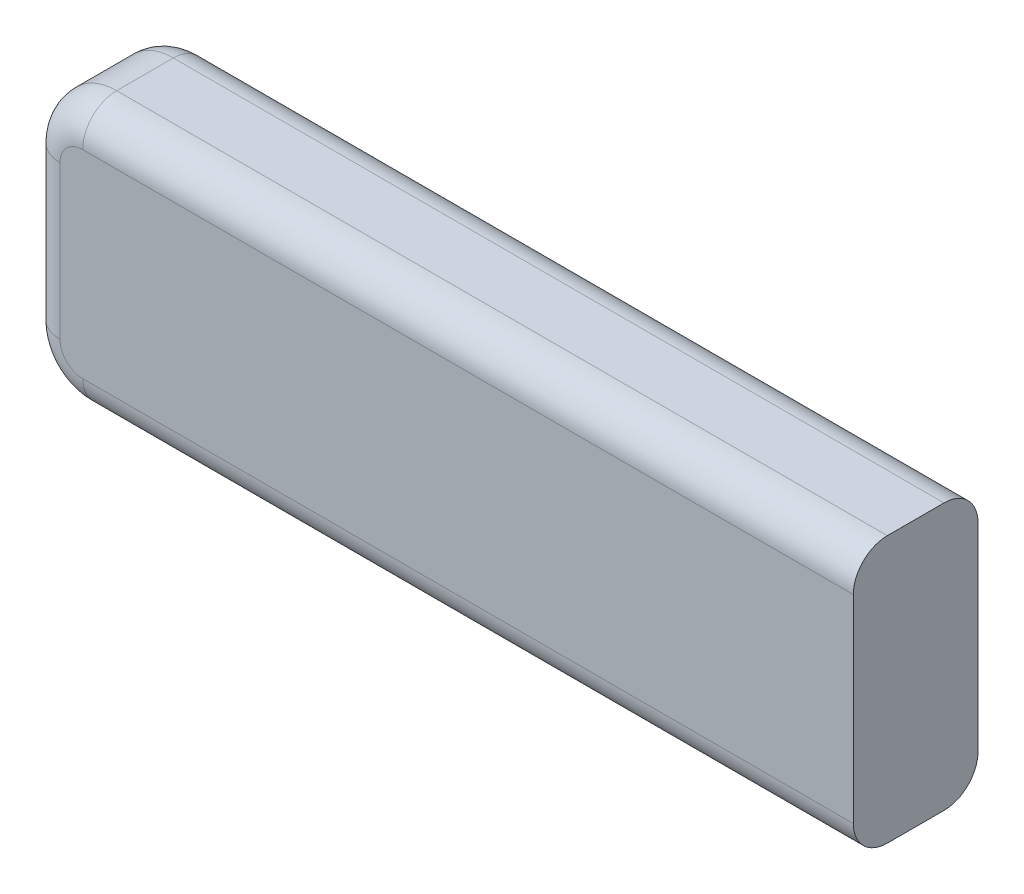
ISO-10303-21;
HEADER;
FILE_DESCRIPTION(('STEP AP214'),'2;1');
FILE_NAME('part.step','',(''),(''),'','','');
FILE_SCHEMA(('AUTOMOTIVE_DESIGN { 1 0 10303 214 1 1 1 1 }'));
ENDSEC;
DATA;
#1=APPLICATION_CONTEXT('core data for automotive mechanical design processes');
#2=APPLICATION_PROTOCOL_DEFINITION('international standard','automotive_design',2000,#1);
#3=PRODUCT_CONTEXT('',#1,'mechanical');
#4=PRODUCT('Part','Part','',(#3));
#5=PRODUCT_RELATED_PRODUCT_CATEGORY('part','',(#4));
#6=PRODUCT_DEFINITION_FORMATION('','',#4);
#7=PRODUCT_DEFINITION_CONTEXT('part definition',#1,'design');
#8=PRODUCT_DEFINITION('design','',#6,#7);
#9=PRODUCT_DEFINITION_SHAPE('','',#8);
#10=(LENGTH_UNIT() NAMED_UNIT(*) SI_UNIT(.MILLI.,.METRE.));
#11=(NAMED_UNIT(*) PLANE_ANGLE_UNIT() SI_UNIT($,.RADIAN.));
#12=(NAMED_UNIT(*) SI_UNIT($,.STERADIAN.) SOLID_ANGLE_UNIT());
#13=UNCERTAINTY_MEASURE_WITH_UNIT(LENGTH_MEASURE(1.E-05),#10,'distance_accuracy_value','');
#14=(GEOMETRIC_REPRESENTATION_CONTEXT(3) GLOBAL_UNCERTAINTY_ASSIGNED_CONTEXT((#13)) GLOBAL_UNIT_ASSIGNED_CONTEXT((#10,
#11,#12)) REPRESENTATION_CONTEXT('',''));
#15=CARTESIAN_POINT('',(0.,0.,0.));
#16=DIRECTION('',(0.,0.,1.));
#17=DIRECTION('',(1.,0.,0.));
#18=AXIS2_PLACEMENT_3D('',#15,#16,#17);
#19=CARTESIAN_POINT('',(0.,0.,5.5));
#20=DIRECTION('',(0.,0.,-1.));
#21=DIRECTION('',(-1.,0.,0.));
#22=AXIS2_PLACEMENT_3D('',#19,#20,#21);
#23=PLANE('',#22);
#24=CARTESIAN_POINT('',(2.5,2.5,5.5));
#25=DIRECTION('',(0.,0.,-1.));
#26=DIRECTION('',(-1.,0.,0.));
#27=AXIS2_PLACEMENT_3D('',#24,#25,#26);
#28=CIRCLE('',#27,1.);
#29=CARTESIAN_POINT('',(2.5,1.5,5.5));
#30=VERTEX_POINT('',#29);
#31=CARTESIAN_POINT('',(1.5,2.5,5.5));
#32=VERTEX_POINT('',#31);
#33=EDGE_CURVE('E203',#30,#32,#28,.T.);
#34=ORIENTED_EDGE('',*,*,#33,.F.);
#35=DIRECTION('',(1.,0.,0.));
#36=VECTOR('',#35,1.);
#37=CARTESIAN_POINT('',(0.,1.5,5.5));
#38=LINE('',#37,#36);
#39=CARTESIAN_POINT('',(36.5,1.5,5.5));
#40=VERTEX_POINT('',#39);
#41=EDGE_CURVE('E176',#30,#40,#38,.T.);
#42=ORIENTED_EDGE('',*,*,#41,.T.);
#43=DIRECTION('',(0.,1.,0.));
#44=VECTOR('',#43,1.);
#45=CARTESIAN_POINT('',(36.5,0.,5.5));
#46=LINE('',#45,#44);
#47=CARTESIAN_POINT('',(36.5,10.25,5.5));
#48=VERTEX_POINT('',#47);
#49=EDGE_CURVE('E140',#40,#48,#46,.T.);
#50=ORIENTED_EDGE('',*,*,#49,.T.);
#51=DIRECTION('',(-1.,0.,0.));
#52=VECTOR('',#51,1.);
#53=CARTESIAN_POINT('',(0.,10.25,5.5));
#54=LINE('',#53,#52);
#55=CARTESIAN_POINT('',(2.5,10.25,5.5));
#56=VERTEX_POINT('',#55);
#57=EDGE_CURVE('E170',#48,#56,#54,.T.);
#58=ORIENTED_EDGE('',*,*,#57,.T.);
#59=CARTESIAN_POINT('',(2.5,9.25,5.5));
#60=DIRECTION('',(0.,0.,-1.));
#61=DIRECTION('',(-1.,0.,0.));
#62=AXIS2_PLACEMENT_3D('',#59,#60,#61);
#63=CIRCLE('',#62,1.);
#64=CARTESIAN_POINT('',(1.5,9.25,5.5));
#65=VERTEX_POINT('',#64);
#66=EDGE_CURVE('E200',#65,#56,#63,.T.);
#67=ORIENTED_EDGE('',*,*,#66,.F.);
#68=DIRECTION('',(0.,-1.,0.));
#69=VECTOR('',#68,1.);
#70=CARTESIAN_POINT('',(1.5,0.,5.5));
#71=LINE('',#70,#69);
#72=EDGE_CURVE('E173',#65,#32,#71,.T.);
#73=ORIENTED_EDGE('',*,*,#72,.T.);
#74=EDGE_LOOP('',(#34,#42,#50,#58,#67,#73));
#75=FACE_BOUND('',#74,.T.);
#76=ADVANCED_FACE('F41',(#75),#23,.F.);
#77=CARTESIAN_POINT('',(0.,0.,0.));
#78=DIRECTION('',(0.,0.,-1.));
#79=DIRECTION('',(-1.,0.,0.));
#80=AXIS2_PLACEMENT_3D('',#77,#78,#79);
#81=PLANE('',#80);
#82=CARTESIAN_POINT('',(2.5,2.5,0.));
#83=DIRECTION('',(0.,0.,-1.));
#84=DIRECTION('',(-1.,0.,0.));
#85=AXIS2_PLACEMENT_3D('',#82,#83,#84);
#86=CIRCLE('',#85,1.);
#87=CARTESIAN_POINT('',(1.5,2.5,0.));
#88=VERTEX_POINT('',#87);
#89=CARTESIAN_POINT('',(2.5,1.5,0.));
#90=VERTEX_POINT('',#89);
#91=EDGE_CURVE('E191',#88,#90,#86,.F.);
#92=ORIENTED_EDGE('',*,*,#91,.F.);
#93=DIRECTION('',(0.,-1.,0.));
#94=VECTOR('',#93,1.);
#95=CARTESIAN_POINT('',(1.5,11.75,0.));
#96=LINE('',#95,#94);
#97=CARTESIAN_POINT('',(1.5,9.25,0.));
#98=VERTEX_POINT('',#97);
#99=EDGE_CURVE('E164',#88,#98,#96,.F.);
#100=ORIENTED_EDGE('',*,*,#99,.T.);
#101=CARTESIAN_POINT('',(2.5,9.25,0.));
#102=DIRECTION('',(0.,0.,-1.));
#103=DIRECTION('',(-1.,0.,0.));
#104=AXIS2_PLACEMENT_3D('',#101,#102,#103);
#105=CIRCLE('',#104,1.);
#106=CARTESIAN_POINT('',(2.5,10.25,0.));
#107=VERTEX_POINT('',#106);
#108=EDGE_CURVE('E188',#107,#98,#105,.F.);
#109=ORIENTED_EDGE('',*,*,#108,.F.);
#110=DIRECTION('',(-1.,0.,0.));
#111=VECTOR('',#110,1.);
#112=CARTESIAN_POINT('',(36.5,10.25,0.));
#113=LINE('',#112,#111);
#114=CARTESIAN_POINT('',(36.5,10.25,0.));
#115=VERTEX_POINT('',#114);
#116=EDGE_CURVE('E162',#107,#115,#113,.F.);
#117=ORIENTED_EDGE('',*,*,#116,.T.);
#118=DIRECTION('',(0.,1.,0.));
#119=VECTOR('',#118,1.);
#120=CARTESIAN_POINT('',(36.5,0.,0.));
#121=LINE('',#120,#119);
#122=CARTESIAN_POINT('',(36.5,1.5,0.));
#123=VERTEX_POINT('',#122);
#124=EDGE_CURVE('E224',#123,#115,#121,.T.);
#125=ORIENTED_EDGE('',*,*,#124,.F.);
#126=DIRECTION('',(1.,0.,0.));
#127=VECTOR('',#126,1.);
#128=CARTESIAN_POINT('',(0.,1.5,0.));
#129=LINE('',#128,#127);
#130=EDGE_CURVE('E167',#123,#90,#129,.F.);
#131=ORIENTED_EDGE('',*,*,#130,.T.);
#132=EDGE_LOOP('',(#92,#100,#109,#117,#125,#131));
#133=FACE_BOUND('',#132,.T.);
#134=ADVANCED_FACE('F269',(#133),#81,.T.);
#135=CARTESIAN_POINT('',(0.,0.,5.5));
#136=DIRECTION('',(1.,0.,0.));
#137=DIRECTION('',(0.,0.,-1.));
#138=AXIS2_PLACEMENT_3D('',#135,#136,#137);
#139=PLANE('',#138);
#140=DIRECTION('',(0.,-1.,0.));
#141=VECTOR('',#140,1.);
#142=CARTESIAN_POINT('',(0.,0.,4.));
#143=LINE('',#142,#141);
#144=CARTESIAN_POINT('',(0.,2.5,4.));
#145=VERTEX_POINT('',#144);
#146=CARTESIAN_POINT('',(0.,9.25,4.));
#147=VERTEX_POINT('',#146);
#148=EDGE_CURVE('E178',#145,#147,#143,.F.);
#149=ORIENTED_EDGE('',*,*,#148,.T.);
#150=DIRECTION('',(0.,0.,-1.));
#151=VECTOR('',#150,1.);
#152=CARTESIAN_POINT('',(0.,9.25,5.5));
#153=LINE('',#152,#151);
#154=CARTESIAN_POINT('',(0.,9.25,1.5));
#155=VERTEX_POINT('',#154);
#156=EDGE_CURVE('E216',#147,#155,#153,.T.);
#157=ORIENTED_EDGE('',*,*,#156,.T.);
#158=DIRECTION('',(0.,-1.,0.));
#159=VECTOR('',#158,1.);
#160=CARTESIAN_POINT('',(0.,0.,1.5));
#161=LINE('',#160,#159);
#162=CARTESIAN_POINT('',(0.,2.5,1.5));
#163=VERTEX_POINT('',#162);
#164=EDGE_CURVE('E181',#155,#163,#161,.T.);
#165=ORIENTED_EDGE('',*,*,#164,.T.);
#166=DIRECTION('',(0.,0.,-1.));
#167=VECTOR('',#166,1.);
#168=CARTESIAN_POINT('',(0.,2.5,5.5));
#169=LINE('',#168,#167);
#170=EDGE_CURVE('E214',#163,#145,#169,.F.);
#171=ORIENTED_EDGE('',*,*,#170,.T.);
#172=EDGE_LOOP('',(#149,#157,#165,#171));
#173=FACE_BOUND('',#172,.T.);
#174=ADVANCED_FACE('F274',(#173),#139,.F.);
#175=CARTESIAN_POINT('',(0.,0.,5.5));
#176=DIRECTION('',(0.,1.,0.));
#177=DIRECTION('',(0.,0.,1.));
#178=AXIS2_PLACEMENT_3D('',#175,#176,#177);
#179=PLANE('',#178);
#180=DIRECTION('',(1.,0.,0.));
#181=VECTOR('',#180,1.);
#182=CARTESIAN_POINT('',(0.,0.,4.));
#183=LINE('',#182,#181);
#184=CARTESIAN_POINT('',(36.5,0.,4.));
#185=VERTEX_POINT('',#184);
#186=CARTESIAN_POINT('',(2.5,0.,4.));
#187=VERTEX_POINT('',#186);
#188=EDGE_CURVE('E146',#185,#187,#183,.F.);
#189=ORIENTED_EDGE('',*,*,#188,.T.);
#190=DIRECTION('',(0.,0.,-1.));
#191=VECTOR('',#190,1.);
#192=CARTESIAN_POINT('',(2.5,0.,5.5));
#193=LINE('',#192,#191);
#194=CARTESIAN_POINT('',(2.5,0.,1.5));
#195=VERTEX_POINT('',#194);
#196=EDGE_CURVE('E11',#187,#195,#193,.T.);
#197=ORIENTED_EDGE('',*,*,#196,.T.);
#198=DIRECTION('',(1.,0.,0.));
#199=VECTOR('',#198,1.);
#200=CARTESIAN_POINT('',(36.5,0.,1.5));
#201=LINE('',#200,#199);
#202=CARTESIAN_POINT('',(36.5,0.,1.5));
#203=VERTEX_POINT('',#202);
#204=EDGE_CURVE('E149',#195,#203,#201,.T.);
#205=ORIENTED_EDGE('',*,*,#204,.T.);
#206=DIRECTION('',(0.,0.,-1.));
#207=VECTOR('',#206,1.);
#208=CARTESIAN_POINT('',(36.5,0.,5.5));
#209=LINE('',#208,#207);
#210=EDGE_CURVE('E138',#185,#203,#209,.T.);
#211=ORIENTED_EDGE('',*,*,#210,.F.);
#212=EDGE_LOOP('',(#189,#197,#205,#211));
#213=FACE_BOUND('',#212,.T.);
#214=ADVANCED_FACE('F145',(#213),#179,.F.);
#215=CARTESIAN_POINT('',(36.5,0.,5.5));
#216=DIRECTION('',(-1.,0.,0.));
#217=DIRECTION('',(0.,0.,1.));
#218=AXIS2_PLACEMENT_3D('',#215,#216,#217);
#219=PLANE('',#218);
#220=ORIENTED_EDGE('',*,*,#210,.T.);
#221=CARTESIAN_POINT('',(36.5,1.5,1.5));
#222=DIRECTION('',(-1.,0.,0.));
#223=DIRECTION('',(0.,0.,1.));
#224=AXIS2_PLACEMENT_3D('',#221,#222,#223);
#225=CIRCLE('',#224,1.5);
#226=EDGE_CURVE('E141',#203,#123,#225,.F.);
#227=ORIENTED_EDGE('',*,*,#226,.T.);
#228=ORIENTED_EDGE('',*,*,#124,.T.);
#229=CARTESIAN_POINT('',(36.5,10.25,1.5));
#230=DIRECTION('',(-1.,0.,0.));
#231=DIRECTION('',(0.,0.,1.));
#232=AXIS2_PLACEMENT_3D('',#229,#230,#231);
#233=CIRCLE('',#232,1.5);
#234=CARTESIAN_POINT('',(36.5,11.75,1.5));
#235=VERTEX_POINT('',#234);
#236=EDGE_CURVE('E142',#115,#235,#233,.F.);
#237=ORIENTED_EDGE('',*,*,#236,.T.);
#238=DIRECTION('',(0.,0.,-1.));
#239=VECTOR('',#238,1.);
#240=CARTESIAN_POINT('',(36.5,11.75,5.5));
#241=LINE('',#240,#239);
#242=CARTESIAN_POINT('',(36.5,11.75,4.));
#243=VERTEX_POINT('',#242);
#244=EDGE_CURVE('E151',#243,#235,#241,.T.);
#245=ORIENTED_EDGE('',*,*,#244,.F.);
#246=CARTESIAN_POINT('',(36.5,10.25,4.));
#247=DIRECTION('',(-1.,0.,0.));
#248=DIRECTION('',(0.,0.,1.));
#249=AXIS2_PLACEMENT_3D('',#246,#247,#248);
#250=CIRCLE('',#249,1.5);
#251=EDGE_CURVE('E155',#243,#48,#250,.F.);
#252=ORIENTED_EDGE('',*,*,#251,.T.);
#253=ORIENTED_EDGE('',*,*,#49,.F.);
#254=CARTESIAN_POINT('',(36.5,1.5,4.));
#255=DIRECTION('',(-1.,0.,0.));
#256=DIRECTION('',(0.,0.,1.));
#257=AXIS2_PLACEMENT_3D('',#254,#255,#256);
#258=CIRCLE('',#257,1.5);
#259=EDGE_CURVE('E135',#40,#185,#258,.F.);
#260=ORIENTED_EDGE('',*,*,#259,.T.);
#261=EDGE_LOOP('',(#220,#227,#228,#237,#245,#252,#253,#260));
#262=FACE_BOUND('',#261,.T.);
#263=ADVANCED_FACE('F137',(#262),#219,.F.);
#264=CARTESIAN_POINT('',(0.,11.75,5.5));
#265=DIRECTION('',(0.,-1.,0.));
#266=DIRECTION('',(0.,0.,-1.));
#267=AXIS2_PLACEMENT_3D('',#264,#265,#266);
#268=PLANE('',#267);
#269=DIRECTION('',(-1.,0.,0.));
#270=VECTOR('',#269,1.);
#271=CARTESIAN_POINT('',(0.,11.75,1.5));
#272=LINE('',#271,#270);
#273=CARTESIAN_POINT('',(2.5,11.75,1.5));
#274=VERTEX_POINT('',#273);
#275=EDGE_CURVE('E186',#235,#274,#272,.T.);
#276=ORIENTED_EDGE('',*,*,#275,.T.);
#277=DIRECTION('',(0.,0.,-1.));
#278=VECTOR('',#277,1.);
#279=CARTESIAN_POINT('',(2.5,11.75,5.5));
#280=LINE('',#279,#278);
#281=CARTESIAN_POINT('',(2.5,11.75,4.));
#282=VERTEX_POINT('',#281);
#283=EDGE_CURVE('E50',#274,#282,#280,.F.);
#284=ORIENTED_EDGE('',*,*,#283,.T.);
#285=DIRECTION('',(-1.,0.,0.));
#286=VECTOR('',#285,1.);
#287=CARTESIAN_POINT('',(0.,11.75,4.));
#288=LINE('',#287,#286);
#289=EDGE_CURVE('E184',#282,#243,#288,.F.);
#290=ORIENTED_EDGE('',*,*,#289,.T.);
#291=ORIENTED_EDGE('',*,*,#244,.T.);
#292=EDGE_LOOP('',(#276,#284,#290,#291));
#293=FACE_BOUND('',#292,.T.);
#294=ADVANCED_FACE('F257',(#293),#268,.F.);
#295=CARTESIAN_POINT('',(0.,10.25,1.5));
#296=DIRECTION('',(1.,0.,0.));
#297=DIRECTION('',(0.,0.,-1.));
#298=AXIS2_PLACEMENT_3D('',#295,#296,#297);
#299=CYLINDRICAL_SURFACE('',#298,1.5);
#300=ORIENTED_EDGE('',*,*,#116,.F.);
#301=CARTESIAN_POINT('',(2.5,10.25,1.5));
#302=DIRECTION('',(1.,0.,0.));
#303=DIRECTION('',(0.,0.,-1.));
#304=AXIS2_PLACEMENT_3D('',#301,#302,#303);
#305=CIRCLE('',#304,1.5);
#306=EDGE_CURVE('E66',#107,#274,#305,.T.);
#307=ORIENTED_EDGE('',*,*,#306,.T.);
#308=ORIENTED_EDGE('',*,*,#275,.F.);
#309=ORIENTED_EDGE('',*,*,#236,.F.);
#310=EDGE_LOOP('',(#300,#307,#308,#309));
#311=FACE_BOUND('',#310,.T.);
#312=ADVANCED_FACE('F255',(#311),#299,.T.);
#313=CARTESIAN_POINT('',(1.5,0.,1.5));
#314=DIRECTION('',(0.,1.,0.));
#315=DIRECTION('',(0.,0.,1.));
#316=AXIS2_PLACEMENT_3D('',#313,#314,#315);
#317=CYLINDRICAL_SURFACE('',#316,1.5);
#318=ORIENTED_EDGE('',*,*,#164,.F.);
#319=CARTESIAN_POINT('',(1.5,9.25,1.5));
#320=DIRECTION('',(0.,-1.,0.));
#321=DIRECTION('',(0.,0.,-1.));
#322=AXIS2_PLACEMENT_3D('',#319,#320,#321);
#323=CIRCLE('',#322,1.5);
#324=EDGE_CURVE('E208',#155,#98,#323,.T.);
#325=ORIENTED_EDGE('',*,*,#324,.T.);
#326=ORIENTED_EDGE('',*,*,#99,.F.);
#327=CARTESIAN_POINT('',(1.5,2.5,1.5));
#328=DIRECTION('',(0.,1.,0.));
#329=DIRECTION('',(0.,0.,1.));
#330=AXIS2_PLACEMENT_3D('',#327,#328,#329);
#331=CIRCLE('',#330,1.5);
#332=EDGE_CURVE('E206',#88,#163,#331,.T.);
#333=ORIENTED_EDGE('',*,*,#332,.T.);
#334=EDGE_LOOP('',(#318,#325,#326,#333));
#335=FACE_BOUND('',#334,.T.);
#336=ADVANCED_FACE('F264',(#335),#317,.T.);
#337=CARTESIAN_POINT('',(0.,1.5,1.5));
#338=DIRECTION('',(-1.,0.,0.));
#339=DIRECTION('',(0.,0.,1.));
#340=AXIS2_PLACEMENT_3D('',#337,#338,#339);
#341=CYLINDRICAL_SURFACE('',#340,1.5);
#342=ORIENTED_EDGE('',*,*,#204,.F.);
#343=CARTESIAN_POINT('',(2.5,1.5,1.5));
#344=DIRECTION('',(1.,0.,0.));
#345=DIRECTION('',(0.,0.,-1.));
#346=AXIS2_PLACEMENT_3D('',#343,#344,#345);
#347=CIRCLE('',#346,1.5);
#348=EDGE_CURVE('E194',#195,#90,#347,.T.);
#349=ORIENTED_EDGE('',*,*,#348,.T.);
#350=ORIENTED_EDGE('',*,*,#130,.F.);
#351=ORIENTED_EDGE('',*,*,#226,.F.);
#352=EDGE_LOOP('',(#342,#349,#350,#351));
#353=FACE_BOUND('',#352,.T.);
#354=ADVANCED_FACE('F308',(#353),#341,.T.);
#355=CARTESIAN_POINT('',(0.,10.25,4.));
#356=DIRECTION('',(-1.,0.,0.));
#357=DIRECTION('',(0.,0.,1.));
#358=AXIS2_PLACEMENT_3D('',#355,#356,#357);
#359=CYLINDRICAL_SURFACE('',#358,1.5);
#360=ORIENTED_EDGE('',*,*,#289,.F.);
#361=CARTESIAN_POINT('',(2.5,10.25,4.));
#362=DIRECTION('',(1.,0.,0.));
#363=DIRECTION('',(0.,0.,-1.));
#364=AXIS2_PLACEMENT_3D('',#361,#362,#363);
#365=CIRCLE('',#364,1.5);
#366=EDGE_CURVE('E210',#282,#56,#365,.T.);
#367=ORIENTED_EDGE('',*,*,#366,.T.);
#368=ORIENTED_EDGE('',*,*,#57,.F.);
#369=ORIENTED_EDGE('',*,*,#251,.F.);
#370=EDGE_LOOP('',(#360,#367,#368,#369));
#371=FACE_BOUND('',#370,.T.);
#372=ADVANCED_FACE('F242',(#371),#359,.T.);
#373=CARTESIAN_POINT('',(1.5,0.,4.));
#374=DIRECTION('',(0.,-1.,0.));
#375=DIRECTION('',(0.,0.,-1.));
#376=AXIS2_PLACEMENT_3D('',#373,#374,#375);
#377=CYLINDRICAL_SURFACE('',#376,1.5);
#378=ORIENTED_EDGE('',*,*,#148,.F.);
#379=CARTESIAN_POINT('',(1.5,2.5,4.));
#380=DIRECTION('',(0.,1.,0.));
#381=DIRECTION('',(0.,0.,1.));
#382=AXIS2_PLACEMENT_3D('',#379,#380,#381);
#383=CIRCLE('',#382,1.5);
#384=EDGE_CURVE('E198',#145,#32,#383,.T.);
#385=ORIENTED_EDGE('',*,*,#384,.T.);
#386=ORIENTED_EDGE('',*,*,#72,.F.);
#387=CARTESIAN_POINT('',(1.5,9.25,4.));
#388=DIRECTION('',(0.,-1.,0.));
#389=DIRECTION('',(0.,0.,-1.));
#390=AXIS2_PLACEMENT_3D('',#387,#388,#389);
#391=CIRCLE('',#390,1.5);
#392=EDGE_CURVE('E196',#65,#147,#391,.T.);
#393=ORIENTED_EDGE('',*,*,#392,.T.);
#394=EDGE_LOOP('',(#378,#385,#386,#393));
#395=FACE_BOUND('',#394,.T.);
#396=ADVANCED_FACE('F307',(#395),#377,.T.);
#397=CARTESIAN_POINT('',(0.,1.5,4.));
#398=DIRECTION('',(1.,0.,0.));
#399=DIRECTION('',(0.,0.,-1.));
#400=AXIS2_PLACEMENT_3D('',#397,#398,#399);
#401=CYLINDRICAL_SURFACE('',#400,1.5);
#402=ORIENTED_EDGE('',*,*,#41,.F.);
#403=CARTESIAN_POINT('',(2.5,1.5,4.));
#404=DIRECTION('',(1.,0.,0.));
#405=DIRECTION('',(0.,0.,-1.));
#406=AXIS2_PLACEMENT_3D('',#403,#404,#405);
#407=CIRCLE('',#406,1.5);
#408=EDGE_CURVE('E58',#30,#187,#407,.T.);
#409=ORIENTED_EDGE('',*,*,#408,.T.);
#410=ORIENTED_EDGE('',*,*,#188,.F.);
#411=ORIENTED_EDGE('',*,*,#259,.F.);
#412=EDGE_LOOP('',(#402,#409,#410,#411));
#413=FACE_BOUND('',#412,.T.);
#414=ADVANCED_FACE('F153',(#413),#401,.T.);
#415=CARTESIAN_POINT('',(2.5,2.5,4.));
#416=DIRECTION('',(0.,0.,-1.));
#417=DIRECTION('',(-1.,0.,0.));
#418=AXIS2_PLACEMENT_3D('',#415,#416,#417);
#419=DEGENERATE_TOROIDAL_SURFACE('',#418,1.,1.5,.T.);
#420=ORIENTED_EDGE('',*,*,#33,.T.);
#421=ORIENTED_EDGE('',*,*,#384,.F.);
#422=CARTESIAN_POINT('',(2.5,2.5,4.));
#423=DIRECTION('',(0.,0.,-1.));
#424=DIRECTION('',(-1.,0.,0.));
#425=AXIS2_PLACEMENT_3D('',#422,#423,#424);
#426=CIRCLE('',#425,2.5);
#427=EDGE_CURVE('E222',#187,#145,#426,.T.);
#428=ORIENTED_EDGE('',*,*,#427,.F.);
#429=ORIENTED_EDGE('',*,*,#408,.F.);
#430=EDGE_LOOP('',(#420,#421,#428,#429));
#431=FACE_BOUND('',#430,.T.);
#432=ADVANCED_FACE('F294',(#431),#419,.T.);
#433=CARTESIAN_POINT('',(2.5,2.5,5.5));
#434=DIRECTION('',(0.,0.,-1.));
#435=DIRECTION('',(-1.,0.,0.));
#436=AXIS2_PLACEMENT_3D('',#433,#434,#435);
#437=CYLINDRICAL_SURFACE('',#436,2.5);
#438=ORIENTED_EDGE('',*,*,#427,.T.);
#439=ORIENTED_EDGE('',*,*,#170,.F.);
#440=CARTESIAN_POINT('',(2.5,2.5,1.5));
#441=DIRECTION('',(0.,0.,-1.));
#442=DIRECTION('',(-1.,0.,0.));
#443=AXIS2_PLACEMENT_3D('',#440,#441,#442);
#444=CIRCLE('',#443,2.5);
#445=EDGE_CURVE('E219',#195,#163,#444,.T.);
#446=ORIENTED_EDGE('',*,*,#445,.F.);
#447=ORIENTED_EDGE('',*,*,#196,.F.);
#448=EDGE_LOOP('',(#438,#439,#446,#447));
#449=FACE_BOUND('',#448,.T.);
#450=ADVANCED_FACE('F297',(#449),#437,.T.);
#451=CARTESIAN_POINT('',(2.5,2.5,1.5));
#452=DIRECTION('',(0.,0.,-1.));
#453=DIRECTION('',(-1.,0.,0.));
#454=AXIS2_PLACEMENT_3D('',#451,#452,#453);
#455=DEGENERATE_TOROIDAL_SURFACE('',#454,1.,1.5,.T.);
#456=ORIENTED_EDGE('',*,*,#332,.F.);
#457=ORIENTED_EDGE('',*,*,#91,.T.);
#458=ORIENTED_EDGE('',*,*,#348,.F.);
#459=ORIENTED_EDGE('',*,*,#445,.T.);
#460=EDGE_LOOP('',(#456,#457,#458,#459));
#461=FACE_BOUND('',#460,.T.);
#462=ADVANCED_FACE('F301',(#461),#455,.T.);
#463=CARTESIAN_POINT('',(2.5,9.25,4.));
#464=DIRECTION('',(0.,0.,-1.));
#465=DIRECTION('',(-1.,0.,0.));
#466=AXIS2_PLACEMENT_3D('',#463,#464,#465);
#467=DEGENERATE_TOROIDAL_SURFACE('',#466,1.,1.5,.T.);
#468=ORIENTED_EDGE('',*,*,#66,.T.);
#469=ORIENTED_EDGE('',*,*,#366,.F.);
#470=CARTESIAN_POINT('',(2.5,9.25,4.));
#471=DIRECTION('',(0.,0.,-1.));
#472=DIRECTION('',(-1.,0.,0.));
#473=AXIS2_PLACEMENT_3D('',#470,#471,#472);
#474=CIRCLE('',#473,2.5);
#475=EDGE_CURVE('E45',#147,#282,#474,.T.);
#476=ORIENTED_EDGE('',*,*,#475,.F.);
#477=ORIENTED_EDGE('',*,*,#392,.F.);
#478=EDGE_LOOP('',(#468,#469,#476,#477));
#479=FACE_BOUND('',#478,.T.);
#480=ADVANCED_FACE('F43',(#479),#467,.T.);
#481=CARTESIAN_POINT('',(2.5,9.25,5.5));
#482=DIRECTION('',(0.,0.,-1.));
#483=DIRECTION('',(-1.,0.,0.));
#484=AXIS2_PLACEMENT_3D('',#481,#482,#483);
#485=CYLINDRICAL_SURFACE('',#484,2.5);
#486=ORIENTED_EDGE('',*,*,#475,.T.);
#487=ORIENTED_EDGE('',*,*,#283,.F.);
#488=CARTESIAN_POINT('',(2.5,9.25,1.5));
#489=DIRECTION('',(0.,0.,-1.));
#490=DIRECTION('',(-1.,0.,0.));
#491=AXIS2_PLACEMENT_3D('',#488,#489,#490);
#492=CIRCLE('',#491,2.5);
#493=EDGE_CURVE('E225',#155,#274,#492,.T.);
#494=ORIENTED_EDGE('',*,*,#493,.F.);
#495=ORIENTED_EDGE('',*,*,#156,.F.);
#496=EDGE_LOOP('',(#486,#487,#494,#495));
#497=FACE_BOUND('',#496,.T.);
#498=ADVANCED_FACE('F235',(#497),#485,.T.);
#499=CARTESIAN_POINT('',(2.5,9.25,1.5));
#500=DIRECTION('',(0.,0.,-1.));
#501=DIRECTION('',(-1.,0.,0.));
#502=AXIS2_PLACEMENT_3D('',#499,#500,#501);
#503=DEGENERATE_TOROIDAL_SURFACE('',#502,1.,1.5,.T.);
#504=ORIENTED_EDGE('',*,*,#306,.F.);
#505=ORIENTED_EDGE('',*,*,#108,.T.);
#506=ORIENTED_EDGE('',*,*,#324,.F.);
#507=ORIENTED_EDGE('',*,*,#493,.T.);
#508=EDGE_LOOP('',(#504,#505,#506,#507));
#509=FACE_BOUND('',#508,.T.);
#510=ADVANCED_FACE('F287',(#509),#503,.T.);
#511=CLOSED_SHELL('',(#76,#134,#174,#214,#263,#294,#312,#336,#354,#372,#396,#414,#432,#450,#462,
#480,#498,#510));
#512=MANIFOLD_SOLID_BREP('B2',#511);
#513=ADVANCED_BREP_SHAPE_REPRESENTATION('',(#18,#512),#14);
#514=SHAPE_DEFINITION_REPRESENTATION(#9,#513);
ENDSEC;
END-ISO-10303-21;
